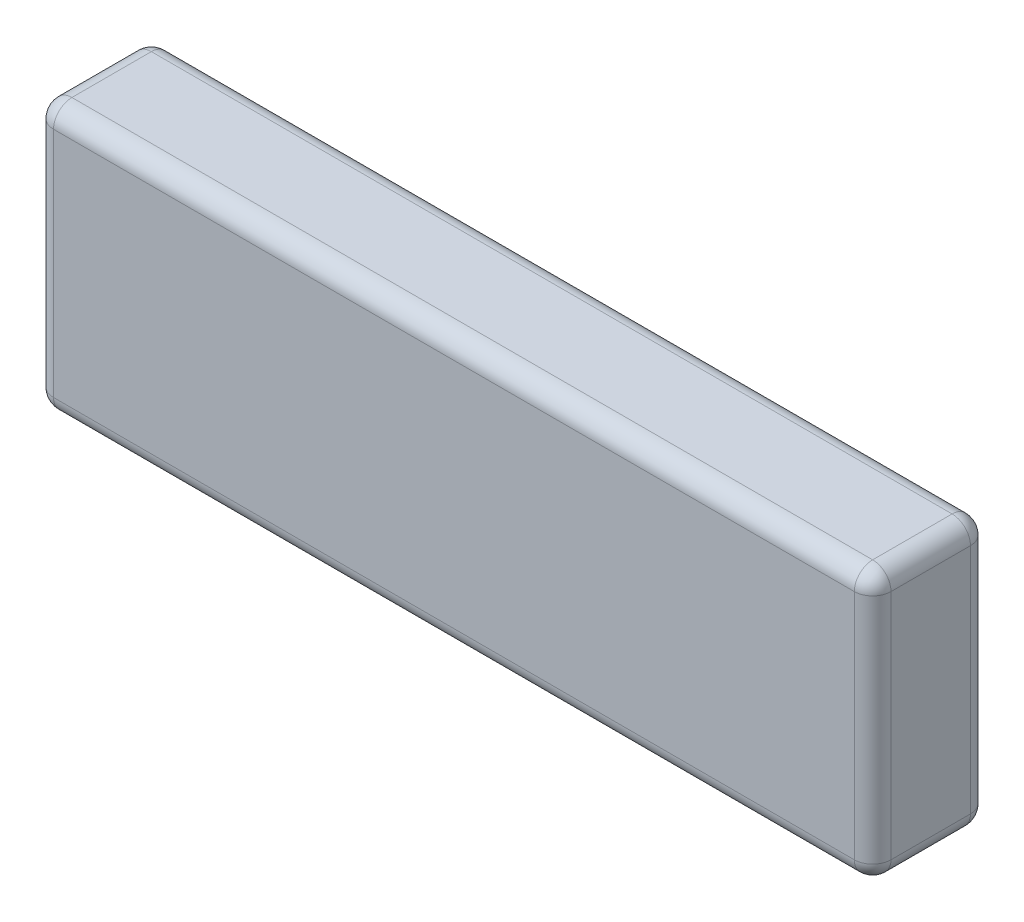
ISO-10303-21;
HEADER;
FILE_DESCRIPTION(('STEP AP214'),'2;1');
FILE_NAME('part.step','',(''),(''),'','','');
FILE_SCHEMA(('AUTOMOTIVE_DESIGN { 1 0 10303 214 1 1 1 1 }'));
ENDSEC;
DATA;
#1=APPLICATION_CONTEXT('core data for automotive mechanical design processes');
#2=APPLICATION_PROTOCOL_DEFINITION('international standard','automotive_design',2000,#1);
#3=PRODUCT_CONTEXT('',#1,'mechanical');
#4=PRODUCT('Part','Part','',(#3));
#5=PRODUCT_RELATED_PRODUCT_CATEGORY('part','',(#4));
#6=PRODUCT_DEFINITION_FORMATION('','',#4);
#7=PRODUCT_DEFINITION_CONTEXT('part definition',#1,'design');
#8=PRODUCT_DEFINITION('design','',#6,#7);
#9=PRODUCT_DEFINITION_SHAPE('','',#8);
#10=(LENGTH_UNIT() NAMED_UNIT(*) SI_UNIT(.MILLI.,.METRE.));
#11=(NAMED_UNIT(*) PLANE_ANGLE_UNIT() SI_UNIT($,.RADIAN.));
#12=(NAMED_UNIT(*) SI_UNIT($,.STERADIAN.) SOLID_ANGLE_UNIT());
#13=UNCERTAINTY_MEASURE_WITH_UNIT(LENGTH_MEASURE(1.E-05),#10,'distance_accuracy_value','');
#14=(GEOMETRIC_REPRESENTATION_CONTEXT(3) GLOBAL_UNCERTAINTY_ASSIGNED_CONTEXT((#13)) GLOBAL_UNIT_ASSIGNED_CONTEXT((#10,
#11,#12)) REPRESENTATION_CONTEXT('',''));
#15=CARTESIAN_POINT('',(0.,0.,0.));
#16=DIRECTION('',(0.,0.,1.));
#17=DIRECTION('',(1.,0.,0.));
#18=AXIS2_PLACEMENT_3D('',#15,#16,#17);
#19=CARTESIAN_POINT('',(65.5,19.,19.));
#20=DIRECTION('',(0.,0.,-1.));
#21=DIRECTION('',(-1.,0.,0.));
#22=AXIS2_PLACEMENT_3D('',#19,#20,#21);
#23=CYLINDRICAL_SURFACE('',#22,3.);
#24=CARTESIAN_POINT('',(65.5,19.,3.));
#25=DIRECTION('',(0.,0.,-1.));
#26=DIRECTION('',(-1.,0.,0.));
#27=AXIS2_PLACEMENT_3D('',#24,#25,#26);
#28=CIRCLE('',#27,3.);
#29=CARTESIAN_POINT('',(65.5,22.,3.));
#30=VERTEX_POINT('',#29);
#31=CARTESIAN_POINT('',(68.5,19.,3.));
#32=VERTEX_POINT('',#31);
#33=EDGE_CURVE('E11',#30,#32,#28,.T.);
#34=ORIENTED_EDGE('',*,*,#33,.F.);
#35=DIRECTION('',(0.,0.,-1.));
#36=VECTOR('',#35,1.);
#37=CARTESIAN_POINT('',(65.5,22.,19.));
#38=LINE('',#37,#36);
#39=CARTESIAN_POINT('',(65.5,22.,16.));
#40=VERTEX_POINT('',#39);
#41=EDGE_CURVE('E236',#40,#30,#38,.T.);
#42=ORIENTED_EDGE('',*,*,#41,.F.);
#43=CARTESIAN_POINT('',(65.5,19.,16.));
#44=DIRECTION('',(0.,0.,-1.));
#45=DIRECTION('',(-1.,0.,0.));
#46=AXIS2_PLACEMENT_3D('',#43,#44,#45);
#47=CIRCLE('',#46,3.);
#48=CARTESIAN_POINT('',(68.5,19.,16.));
#49=VERTEX_POINT('',#48);
#50=EDGE_CURVE('E42',#40,#49,#47,.T.);
#51=ORIENTED_EDGE('',*,*,#50,.T.);
#52=DIRECTION('',(0.,0.,-1.));
#53=VECTOR('',#52,1.);
#54=CARTESIAN_POINT('',(68.5,19.,19.));
#55=LINE('',#54,#53);
#56=EDGE_CURVE('E211',#32,#49,#55,.F.);
#57=ORIENTED_EDGE('',*,*,#56,.F.);
#58=EDGE_LOOP('',(#34,#42,#51,#57));
#59=FACE_BOUND('',#58,.T.);
#60=ADVANCED_FACE('F35',(#59),#23,.T.);
#61=CARTESIAN_POINT('',(65.5,19.,16.));
#62=DIRECTION('',(-1.,0.,0.));
#63=DIRECTION('',(0.,0.,1.));
#64=AXIS2_PLACEMENT_3D('',#61,#62,#63);
#65=SPHERICAL_SURFACE('',#64,3.);
#66=ORIENTED_EDGE('',*,*,#50,.F.);
#67=CARTESIAN_POINT('',(65.5,19.,16.));
#68=DIRECTION('',(1.,0.,0.));
#69=DIRECTION('',(0.,0.,-1.));
#70=AXIS2_PLACEMENT_3D('',#67,#68,#69);
#71=CIRCLE('',#70,3.);
#72=CARTESIAN_POINT('',(65.5,19.,19.));
#73=VERTEX_POINT('',#72);
#74=EDGE_CURVE('E157',#73,#40,#71,.F.);
#75=ORIENTED_EDGE('',*,*,#74,.F.);
#76=CARTESIAN_POINT('',(65.5,19.,16.));
#77=DIRECTION('',(0.,1.,0.));
#78=DIRECTION('',(0.,0.,1.));
#79=AXIS2_PLACEMENT_3D('',#76,#77,#78);
#80=CIRCLE('',#79,3.);
#81=EDGE_CURVE('E55',#73,#49,#80,.T.);
#82=ORIENTED_EDGE('',*,*,#81,.T.);
#83=EDGE_LOOP('',(#66,#75,#82));
#84=FACE_BOUND('',#83,.T.);
#85=ADVANCED_FACE('F253',(#84),#65,.T.);
#86=CARTESIAN_POINT('',(65.5,0.,16.));
#87=DIRECTION('',(0.,-1.,0.));
#88=DIRECTION('',(0.,0.,-1.));
#89=AXIS2_PLACEMENT_3D('',#86,#87,#88);
#90=CYLINDRICAL_SURFACE('',#89,3.);
#91=ORIENTED_EDGE('',*,*,#81,.F.);
#92=DIRECTION('',(0.,1.,0.));
#93=VECTOR('',#92,1.);
#94=CARTESIAN_POINT('',(65.5,0.,19.));
#95=LINE('',#94,#93);
#96=CARTESIAN_POINT('',(65.5,-19.,19.));
#97=VERTEX_POINT('',#96);
#98=EDGE_CURVE('E232',#97,#73,#95,.T.);
#99=ORIENTED_EDGE('',*,*,#98,.F.);
#100=CARTESIAN_POINT('',(65.5,-19.,16.));
#101=DIRECTION('',(0.,1.,0.));
#102=DIRECTION('',(0.,0.,1.));
#103=AXIS2_PLACEMENT_3D('',#100,#101,#102);
#104=CIRCLE('',#103,3.);
#105=CARTESIAN_POINT('',(68.5,-19.,16.));
#106=VERTEX_POINT('',#105);
#107=EDGE_CURVE('E249',#97,#106,#104,.T.);
#108=ORIENTED_EDGE('',*,*,#107,.T.);
#109=DIRECTION('',(0.,1.,0.));
#110=VECTOR('',#109,1.);
#111=CARTESIAN_POINT('',(68.5,0.,16.));
#112=LINE('',#111,#110);
#113=EDGE_CURVE('E214',#49,#106,#112,.F.);
#114=ORIENTED_EDGE('',*,*,#113,.F.);
#115=EDGE_LOOP('',(#91,#99,#108,#114));
#116=FACE_BOUND('',#115,.T.);
#117=ADVANCED_FACE('F254',(#116),#90,.T.);
#118=CARTESIAN_POINT('',(65.5,-19.,16.));
#119=DIRECTION('',(-1.,0.,0.));
#120=DIRECTION('',(0.,0.,1.));
#121=AXIS2_PLACEMENT_3D('',#118,#119,#120);
#122=SPHERICAL_SURFACE('',#121,3.);
#123=ORIENTED_EDGE('',*,*,#107,.F.);
#124=CARTESIAN_POINT('',(65.5,-19.,16.));
#125=DIRECTION('',(1.,0.,0.));
#126=DIRECTION('',(0.,0.,-1.));
#127=AXIS2_PLACEMENT_3D('',#124,#125,#126);
#128=CIRCLE('',#127,3.);
#129=CARTESIAN_POINT('',(65.5,-22.,16.));
#130=VERTEX_POINT('',#129);
#131=EDGE_CURVE('E229',#130,#97,#128,.F.);
#132=ORIENTED_EDGE('',*,*,#131,.F.);
#133=CARTESIAN_POINT('',(65.5,-19.,16.));
#134=DIRECTION('',(0.,0.,1.));
#135=DIRECTION('',(1.,0.,0.));
#136=AXIS2_PLACEMENT_3D('',#133,#134,#135);
#137=CIRCLE('',#136,3.);
#138=EDGE_CURVE('E246',#130,#106,#137,.T.);
#139=ORIENTED_EDGE('',*,*,#138,.T.);
#140=EDGE_LOOP('',(#123,#132,#139));
#141=FACE_BOUND('',#140,.T.);
#142=ADVANCED_FACE('F337',(#141),#122,.T.);
#143=CARTESIAN_POINT('',(65.5,-19.,19.));
#144=DIRECTION('',(0.,0.,1.));
#145=DIRECTION('',(1.,0.,0.));
#146=AXIS2_PLACEMENT_3D('',#143,#144,#145);
#147=CYLINDRICAL_SURFACE('',#146,3.);
#148=ORIENTED_EDGE('',*,*,#138,.F.);
#149=DIRECTION('',(0.,0.,1.));
#150=VECTOR('',#149,1.);
#151=CARTESIAN_POINT('',(65.5,-22.,19.));
#152=LINE('',#151,#150);
#153=CARTESIAN_POINT('',(65.5,-22.,3.));
#154=VERTEX_POINT('',#153);
#155=EDGE_CURVE('E226',#154,#130,#152,.T.);
#156=ORIENTED_EDGE('',*,*,#155,.F.);
#157=CARTESIAN_POINT('',(65.5,-19.,3.));
#158=DIRECTION('',(0.,0.,1.));
#159=DIRECTION('',(1.,0.,0.));
#160=AXIS2_PLACEMENT_3D('',#157,#158,#159);
#161=CIRCLE('',#160,3.);
#162=CARTESIAN_POINT('',(68.5,-19.,3.));
#163=VERTEX_POINT('',#162);
#164=EDGE_CURVE('E244',#154,#163,#161,.T.);
#165=ORIENTED_EDGE('',*,*,#164,.T.);
#166=DIRECTION('',(0.,0.,1.));
#167=VECTOR('',#166,1.);
#168=CARTESIAN_POINT('',(68.5,-19.,19.));
#169=LINE('',#168,#167);
#170=EDGE_CURVE('E217',#106,#163,#169,.F.);
#171=ORIENTED_EDGE('',*,*,#170,.F.);
#172=EDGE_LOOP('',(#148,#156,#165,#171));
#173=FACE_BOUND('',#172,.T.);
#174=ADVANCED_FACE('F342',(#173),#147,.T.);
#175=CARTESIAN_POINT('',(65.5,-19.,3.));
#176=DIRECTION('',(-1.,0.,0.));
#177=DIRECTION('',(0.,0.,1.));
#178=AXIS2_PLACEMENT_3D('',#175,#176,#177);
#179=SPHERICAL_SURFACE('',#178,3.);
#180=ORIENTED_EDGE('',*,*,#164,.F.);
#181=CARTESIAN_POINT('',(65.5,-19.,3.));
#182=DIRECTION('',(1.,0.,0.));
#183=DIRECTION('',(0.,0.,-1.));
#184=AXIS2_PLACEMENT_3D('',#181,#182,#183);
#185=CIRCLE('',#184,3.);
#186=CARTESIAN_POINT('',(65.5,-19.,0.));
#187=VERTEX_POINT('',#186);
#188=EDGE_CURVE('E223',#187,#154,#185,.F.);
#189=ORIENTED_EDGE('',*,*,#188,.F.);
#190=CARTESIAN_POINT('',(65.5,-19.,3.));
#191=DIRECTION('',(0.,-1.,0.));
#192=DIRECTION('',(0.,0.,-1.));
#193=AXIS2_PLACEMENT_3D('',#190,#191,#192);
#194=CIRCLE('',#193,3.);
#195=EDGE_CURVE('E241',#187,#163,#194,.T.);
#196=ORIENTED_EDGE('',*,*,#195,.T.);
#197=EDGE_LOOP('',(#180,#189,#196));
#198=FACE_BOUND('',#197,.T.);
#199=ADVANCED_FACE('F308',(#198),#179,.T.);
#200=CARTESIAN_POINT('',(65.5,0.,3.));
#201=DIRECTION('',(0.,-1.,0.));
#202=DIRECTION('',(0.,0.,-1.));
#203=AXIS2_PLACEMENT_3D('',#200,#201,#202);
#204=CYLINDRICAL_SURFACE('',#203,3.);
#205=ORIENTED_EDGE('',*,*,#195,.F.);
#206=DIRECTION('',(0.,-1.,0.));
#207=VECTOR('',#206,1.);
#208=CARTESIAN_POINT('',(65.5,0.,0.));
#209=LINE('',#208,#207);
#210=CARTESIAN_POINT('',(65.5,19.,0.));
#211=VERTEX_POINT('',#210);
#212=EDGE_CURVE('E208',#211,#187,#209,.T.);
#213=ORIENTED_EDGE('',*,*,#212,.F.);
#214=CARTESIAN_POINT('',(65.5,19.,3.));
#215=DIRECTION('',(0.,-1.,0.));
#216=DIRECTION('',(0.,0.,-1.));
#217=AXIS2_PLACEMENT_3D('',#214,#215,#216);
#218=CIRCLE('',#217,3.);
#219=EDGE_CURVE('E238',#211,#32,#218,.T.);
#220=ORIENTED_EDGE('',*,*,#219,.T.);
#221=DIRECTION('',(0.,-1.,0.));
#222=VECTOR('',#221,1.);
#223=CARTESIAN_POINT('',(68.5,-22.,3.));
#224=LINE('',#223,#222);
#225=EDGE_CURVE('E220',#163,#32,#224,.F.);
#226=ORIENTED_EDGE('',*,*,#225,.F.);
#227=EDGE_LOOP('',(#205,#213,#220,#226));
#228=FACE_BOUND('',#227,.T.);
#229=ADVANCED_FACE('F260',(#228),#204,.T.);
#230=CARTESIAN_POINT('',(65.5,19.,3.));
#231=DIRECTION('',(-1.,0.,0.));
#232=DIRECTION('',(0.,0.,1.));
#233=AXIS2_PLACEMENT_3D('',#230,#231,#232);
#234=SPHERICAL_SURFACE('',#233,3.);
#235=CARTESIAN_POINT('',(65.5,19.,3.));
#236=DIRECTION('',(1.,0.,0.));
#237=DIRECTION('',(0.,0.,-1.));
#238=AXIS2_PLACEMENT_3D('',#235,#236,#237);
#239=CIRCLE('',#238,3.);
#240=EDGE_CURVE('E205',#30,#211,#239,.F.);
#241=ORIENTED_EDGE('',*,*,#240,.F.);
#242=ORIENTED_EDGE('',*,*,#33,.T.);
#243=ORIENTED_EDGE('',*,*,#219,.F.);
#244=EDGE_LOOP('',(#241,#242,#243));
#245=FACE_BOUND('',#244,.T.);
#246=ADVANCED_FACE('F265',(#245),#234,.T.);
#247=CARTESIAN_POINT('',(-65.5,19.,3.));
#248=DIRECTION('',(0.,0.,1.));
#249=DIRECTION('',(1.,0.,0.));
#250=AXIS2_PLACEMENT_3D('',#247,#248,#249);
#251=SPHERICAL_SURFACE('',#250,3.);
#252=CARTESIAN_POINT('',(-65.5,19.,3.));
#253=DIRECTION('',(1.,0.,0.));
#254=DIRECTION('',(0.,0.,-1.));
#255=AXIS2_PLACEMENT_3D('',#252,#253,#254);
#256=CIRCLE('',#255,3.);
#257=CARTESIAN_POINT('',(-65.5,19.,0.));
#258=VERTEX_POINT('',#257);
#259=CARTESIAN_POINT('',(-65.5,22.,3.));
#260=VERTEX_POINT('',#259);
#261=EDGE_CURVE('E203',#258,#260,#256,.T.);
#262=ORIENTED_EDGE('',*,*,#261,.F.);
#263=CARTESIAN_POINT('',(-65.5,19.,3.));
#264=DIRECTION('',(0.,1.,0.));
#265=DIRECTION('',(0.,0.,1.));
#266=AXIS2_PLACEMENT_3D('',#263,#264,#265);
#267=CIRCLE('',#266,3.);
#268=CARTESIAN_POINT('',(-68.5,19.,3.));
#269=VERTEX_POINT('',#268);
#270=EDGE_CURVE('E201',#258,#269,#267,.T.);
#271=ORIENTED_EDGE('',*,*,#270,.T.);
#272=CARTESIAN_POINT('',(-65.5,19.,3.));
#273=DIRECTION('',(0.,0.,-1.));
#274=DIRECTION('',(-1.,0.,0.));
#275=AXIS2_PLACEMENT_3D('',#272,#273,#274);
#276=CIRCLE('',#275,3.);
#277=EDGE_CURVE('E134',#260,#269,#276,.F.);
#278=ORIENTED_EDGE('',*,*,#277,.F.);
#279=EDGE_LOOP('',(#262,#271,#278));
#280=FACE_BOUND('',#279,.T.);
#281=ADVANCED_FACE('F272',(#280),#251,.T.);
#282=CARTESIAN_POINT('',(-65.5,0.,3.));
#283=DIRECTION('',(0.,1.,0.));
#284=DIRECTION('',(0.,0.,1.));
#285=AXIS2_PLACEMENT_3D('',#282,#283,#284);
#286=CYLINDRICAL_SURFACE('',#285,3.);
#287=ORIENTED_EDGE('',*,*,#270,.F.);
#288=DIRECTION('',(0.,1.,0.));
#289=VECTOR('',#288,1.);
#290=CARTESIAN_POINT('',(-65.5,0.,0.));
#291=LINE('',#290,#289);
#292=CARTESIAN_POINT('',(-65.5,-19.,0.));
#293=VERTEX_POINT('',#292);
#294=EDGE_CURVE('E186',#293,#258,#291,.T.);
#295=ORIENTED_EDGE('',*,*,#294,.F.);
#296=CARTESIAN_POINT('',(-65.5,-19.,3.));
#297=DIRECTION('',(0.,1.,0.));
#298=DIRECTION('',(0.,0.,1.));
#299=AXIS2_PLACEMENT_3D('',#296,#297,#298);
#300=CIRCLE('',#299,3.);
#301=CARTESIAN_POINT('',(-68.5,-19.,3.));
#302=VERTEX_POINT('',#301);
#303=EDGE_CURVE('E199',#293,#302,#300,.T.);
#304=ORIENTED_EDGE('',*,*,#303,.T.);
#305=DIRECTION('',(0.,1.,0.));
#306=VECTOR('',#305,1.);
#307=CARTESIAN_POINT('',(-68.5,-22.,3.));
#308=LINE('',#307,#306);
#309=EDGE_CURVE('E165',#269,#302,#308,.F.);
#310=ORIENTED_EDGE('',*,*,#309,.F.);
#311=EDGE_LOOP('',(#287,#295,#304,#310));
#312=FACE_BOUND('',#311,.T.);
#313=ADVANCED_FACE('F314',(#312),#286,.T.);
#314=CARTESIAN_POINT('',(-65.5,-19.,3.));
#315=DIRECTION('',(1.,0.,0.));
#316=DIRECTION('',(0.,0.,-1.));
#317=AXIS2_PLACEMENT_3D('',#314,#315,#316);
#318=SPHERICAL_SURFACE('',#317,3.);
#319=ORIENTED_EDGE('',*,*,#303,.F.);
#320=CARTESIAN_POINT('',(-65.5,-19.,3.));
#321=DIRECTION('',(1.,0.,0.));
#322=DIRECTION('',(0.,0.,-1.));
#323=AXIS2_PLACEMENT_3D('',#320,#321,#322);
#324=CIRCLE('',#323,3.);
#325=CARTESIAN_POINT('',(-65.5,-22.,3.));
#326=VERTEX_POINT('',#325);
#327=EDGE_CURVE('E180',#326,#293,#324,.T.);
#328=ORIENTED_EDGE('',*,*,#327,.F.);
#329=CARTESIAN_POINT('',(-65.5,-19.,3.));
#330=DIRECTION('',(0.,0.,-1.));
#331=DIRECTION('',(-1.,0.,0.));
#332=AXIS2_PLACEMENT_3D('',#329,#330,#331);
#333=CIRCLE('',#332,3.);
#334=EDGE_CURVE('E196',#326,#302,#333,.T.);
#335=ORIENTED_EDGE('',*,*,#334,.T.);
#336=EDGE_LOOP('',(#319,#328,#335));
#337=FACE_BOUND('',#336,.T.);
#338=ADVANCED_FACE('F316',(#337),#318,.T.);
#339=CARTESIAN_POINT('',(-65.5,-19.,19.));
#340=DIRECTION('',(0.,0.,-1.));
#341=DIRECTION('',(-1.,0.,0.));
#342=AXIS2_PLACEMENT_3D('',#339,#340,#341);
#343=CYLINDRICAL_SURFACE('',#342,3.);
#344=ORIENTED_EDGE('',*,*,#334,.F.);
#345=DIRECTION('',(0.,0.,-1.));
#346=VECTOR('',#345,1.);
#347=CARTESIAN_POINT('',(-65.5,-22.,19.));
#348=LINE('',#347,#346);
#349=CARTESIAN_POINT('',(-65.5,-22.,16.));
#350=VERTEX_POINT('',#349);
#351=EDGE_CURVE('E177',#350,#326,#348,.T.);
#352=ORIENTED_EDGE('',*,*,#351,.F.);
#353=CARTESIAN_POINT('',(-65.5,-19.,16.));
#354=DIRECTION('',(0.,0.,-1.));
#355=DIRECTION('',(-1.,0.,0.));
#356=AXIS2_PLACEMENT_3D('',#353,#354,#355);
#357=CIRCLE('',#356,3.);
#358=CARTESIAN_POINT('',(-68.5,-19.,16.));
#359=VERTEX_POINT('',#358);
#360=EDGE_CURVE('E194',#350,#359,#357,.T.);
#361=ORIENTED_EDGE('',*,*,#360,.T.);
#362=DIRECTION('',(0.,0.,-1.));
#363=VECTOR('',#362,1.);
#364=CARTESIAN_POINT('',(-68.5,-19.,19.));
#365=LINE('',#364,#363);
#366=EDGE_CURVE('E168',#302,#359,#365,.F.);
#367=ORIENTED_EDGE('',*,*,#366,.F.);
#368=EDGE_LOOP('',(#344,#352,#361,#367));
#369=FACE_BOUND('',#368,.T.);
#370=ADVANCED_FACE('F318',(#369),#343,.T.);
#371=CARTESIAN_POINT('',(-65.5,-19.,16.));
#372=DIRECTION('',(1.,0.,0.));
#373=DIRECTION('',(0.,0.,-1.));
#374=AXIS2_PLACEMENT_3D('',#371,#372,#373);
#375=SPHERICAL_SURFACE('',#374,3.);
#376=ORIENTED_EDGE('',*,*,#360,.F.);
#377=CARTESIAN_POINT('',(-65.5,-19.,16.));
#378=DIRECTION('',(1.,0.,0.));
#379=DIRECTION('',(0.,0.,-1.));
#380=AXIS2_PLACEMENT_3D('',#377,#378,#379);
#381=CIRCLE('',#380,3.);
#382=CARTESIAN_POINT('',(-65.5,-19.,19.));
#383=VERTEX_POINT('',#382);
#384=EDGE_CURVE('E174',#383,#350,#381,.T.);
#385=ORIENTED_EDGE('',*,*,#384,.F.);
#386=CARTESIAN_POINT('',(-65.5,-19.,16.));
#387=DIRECTION('',(0.,-1.,0.));
#388=DIRECTION('',(0.,0.,-1.));
#389=AXIS2_PLACEMENT_3D('',#386,#387,#388);
#390=CIRCLE('',#389,3.);
#391=EDGE_CURVE('E191',#383,#359,#390,.T.);
#392=ORIENTED_EDGE('',*,*,#391,.T.);
#393=EDGE_LOOP('',(#376,#385,#392));
#394=FACE_BOUND('',#393,.T.);
#395=ADVANCED_FACE('F321',(#394),#375,.T.);
#396=CARTESIAN_POINT('',(-65.5,0.,16.));
#397=DIRECTION('',(0.,1.,0.));
#398=DIRECTION('',(0.,0.,1.));
#399=AXIS2_PLACEMENT_3D('',#396,#397,#398);
#400=CYLINDRICAL_SURFACE('',#399,3.);
#401=ORIENTED_EDGE('',*,*,#391,.F.);
#402=DIRECTION('',(0.,-1.,0.));
#403=VECTOR('',#402,1.);
#404=CARTESIAN_POINT('',(-65.5,0.,19.));
#405=LINE('',#404,#403);
#406=CARTESIAN_POINT('',(-65.5,19.,19.));
#407=VERTEX_POINT('',#406);
#408=EDGE_CURVE('E133',#407,#383,#405,.T.);
#409=ORIENTED_EDGE('',*,*,#408,.F.);
#410=CARTESIAN_POINT('',(-65.5,19.,16.));
#411=DIRECTION('',(0.,-1.,0.));
#412=DIRECTION('',(1.,0.,0.));
#413=AXIS2_PLACEMENT_3D('',#410,#411,#412);
#414=CIRCLE('',#413,3.);
#415=CARTESIAN_POINT('',(-68.5,19.,16.));
#416=VERTEX_POINT('',#415);
#417=EDGE_CURVE('E150',#407,#416,#414,.T.);
#418=ORIENTED_EDGE('',*,*,#417,.T.);
#419=DIRECTION('',(0.,-1.,0.));
#420=VECTOR('',#419,1.);
#421=CARTESIAN_POINT('',(-68.5,0.,16.));
#422=LINE('',#421,#420);
#423=EDGE_CURVE('E171',#359,#416,#422,.F.);
#424=ORIENTED_EDGE('',*,*,#423,.F.);
#425=EDGE_LOOP('',(#401,#409,#418,#424));
#426=FACE_BOUND('',#425,.T.);
#427=ADVANCED_FACE('F279',(#426),#400,.T.);
#428=CARTESIAN_POINT('',(-65.5,19.,16.));
#429=DIRECTION('',(0.,0.,1.));
#430=DIRECTION('',(1.,0.,0.));
#431=AXIS2_PLACEMENT_3D('',#428,#429,#430);
#432=SPHERICAL_SURFACE('',#431,3.);
#433=ORIENTED_EDGE('',*,*,#417,.F.);
#434=CARTESIAN_POINT('',(-65.5,19.,16.));
#435=DIRECTION('',(1.,0.,0.));
#436=DIRECTION('',(0.,0.,-1.));
#437=AXIS2_PLACEMENT_3D('',#434,#435,#436);
#438=CIRCLE('',#437,3.);
#439=CARTESIAN_POINT('',(-65.5,22.,16.));
#440=VERTEX_POINT('',#439);
#441=EDGE_CURVE('E148',#440,#407,#438,.T.);
#442=ORIENTED_EDGE('',*,*,#441,.F.);
#443=CARTESIAN_POINT('',(-65.5,19.,16.));
#444=DIRECTION('',(0.,0.,-1.));
#445=DIRECTION('',(-1.,0.,0.));
#446=AXIS2_PLACEMENT_3D('',#443,#444,#445);
#447=CIRCLE('',#446,3.);
#448=EDGE_CURVE('E123',#416,#440,#447,.T.);
#449=ORIENTED_EDGE('',*,*,#448,.F.);
#450=EDGE_LOOP('',(#433,#442,#449));
#451=FACE_BOUND('',#450,.T.);
#452=ADVANCED_FACE('F149',(#451),#432,.T.);
#453=CARTESIAN_POINT('',(0.,19.,3.));
#454=DIRECTION('',(1.,0.,0.));
#455=DIRECTION('',(0.,0.,-1.));
#456=AXIS2_PLACEMENT_3D('',#453,#454,#455);
#457=CYLINDRICAL_SURFACE('',#456,3.);
#458=DIRECTION('',(1.,0.,0.));
#459=VECTOR('',#458,1.);
#460=CARTESIAN_POINT('',(68.5,22.,3.));
#461=LINE('',#460,#459);
#462=EDGE_CURVE('E143',#30,#260,#461,.F.);
#463=ORIENTED_EDGE('',*,*,#462,.F.);
#464=ORIENTED_EDGE('',*,*,#240,.T.);
#465=DIRECTION('',(1.,0.,0.));
#466=VECTOR('',#465,1.);
#467=CARTESIAN_POINT('',(0.,19.,0.));
#468=LINE('',#467,#466);
#469=EDGE_CURVE('E183',#258,#211,#468,.T.);
#470=ORIENTED_EDGE('',*,*,#469,.F.);
#471=ORIENTED_EDGE('',*,*,#261,.T.);
#472=EDGE_LOOP('',(#463,#464,#470,#471));
#473=FACE_BOUND('',#472,.T.);
#474=ADVANCED_FACE('F268',(#473),#457,.T.);
#475=CARTESIAN_POINT('',(0.,19.,16.));
#476=DIRECTION('',(1.,0.,0.));
#477=DIRECTION('',(0.,0.,-1.));
#478=AXIS2_PLACEMENT_3D('',#475,#476,#477);
#479=CYLINDRICAL_SURFACE('',#478,3.);
#480=DIRECTION('',(-1.,0.,0.));
#481=VECTOR('',#480,1.);
#482=CARTESIAN_POINT('',(0.,19.,19.));
#483=LINE('',#482,#481);
#484=EDGE_CURVE('E145',#73,#407,#483,.T.);
#485=ORIENTED_EDGE('',*,*,#484,.F.);
#486=ORIENTED_EDGE('',*,*,#74,.T.);
#487=DIRECTION('',(-1.,0.,0.));
#488=VECTOR('',#487,1.);
#489=CARTESIAN_POINT('',(0.,22.,16.));
#490=LINE('',#489,#488);
#491=EDGE_CURVE('E141',#440,#40,#490,.F.);
#492=ORIENTED_EDGE('',*,*,#491,.F.);
#493=ORIENTED_EDGE('',*,*,#441,.T.);
#494=EDGE_LOOP('',(#485,#486,#492,#493));
#495=FACE_BOUND('',#494,.T.);
#496=ADVANCED_FACE('F156',(#495),#479,.T.);
#497=CARTESIAN_POINT('',(-65.5,19.,19.));
#498=DIRECTION('',(0.,0.,-1.));
#499=DIRECTION('',(-1.,0.,0.));
#500=AXIS2_PLACEMENT_3D('',#497,#498,#499);
#501=CYLINDRICAL_SURFACE('',#500,3.);
#502=DIRECTION('',(0.,0.,-1.));
#503=VECTOR('',#502,1.);
#504=CARTESIAN_POINT('',(-68.5,19.,19.));
#505=LINE('',#504,#503);
#506=EDGE_CURVE('E129',#416,#269,#505,.T.);
#507=ORIENTED_EDGE('',*,*,#506,.F.);
#508=ORIENTED_EDGE('',*,*,#448,.T.);
#509=DIRECTION('',(0.,0.,-1.));
#510=VECTOR('',#509,1.);
#511=CARTESIAN_POINT('',(-65.5,22.,19.));
#512=LINE('',#511,#510);
#513=EDGE_CURVE('E127',#260,#440,#512,.F.);
#514=ORIENTED_EDGE('',*,*,#513,.F.);
#515=ORIENTED_EDGE('',*,*,#277,.T.);
#516=EDGE_LOOP('',(#507,#508,#514,#515));
#517=FACE_BOUND('',#516,.T.);
#518=ADVANCED_FACE('F125',(#517),#501,.T.);
#519=CARTESIAN_POINT('',(68.5,-19.,16.));
#520=DIRECTION('',(1.,0.,0.));
#521=DIRECTION('',(0.,0.,-1.));
#522=AXIS2_PLACEMENT_3D('',#519,#520,#521);
#523=CYLINDRICAL_SURFACE('',#522,3.);
#524=DIRECTION('',(-1.,0.,0.));
#525=VECTOR('',#524,1.);
#526=CARTESIAN_POINT('',(68.5,-22.,16.));
#527=LINE('',#526,#525);
#528=EDGE_CURVE('E290',#130,#350,#527,.T.);
#529=ORIENTED_EDGE('',*,*,#528,.F.);
#530=ORIENTED_EDGE('',*,*,#131,.T.);
#531=DIRECTION('',(-1.,0.,0.));
#532=VECTOR('',#531,1.);
#533=CARTESIAN_POINT('',(68.5,-19.,19.));
#534=LINE('',#533,#532);
#535=EDGE_CURVE('E285',#383,#97,#534,.F.);
#536=ORIENTED_EDGE('',*,*,#535,.F.);
#537=ORIENTED_EDGE('',*,*,#384,.T.);
#538=EDGE_LOOP('',(#529,#530,#536,#537));
#539=FACE_BOUND('',#538,.T.);
#540=ADVANCED_FACE('F288',(#539),#523,.T.);
#541=CARTESIAN_POINT('',(68.5,-19.,3.));
#542=DIRECTION('',(1.,0.,0.));
#543=DIRECTION('',(0.,0.,-1.));
#544=AXIS2_PLACEMENT_3D('',#541,#542,#543);
#545=CYLINDRICAL_SURFACE('',#544,3.);
#546=DIRECTION('',(1.,0.,0.));
#547=VECTOR('',#546,1.);
#548=CARTESIAN_POINT('',(0.,-19.,0.));
#549=LINE('',#548,#547);
#550=EDGE_CURVE('E292',#187,#293,#549,.F.);
#551=ORIENTED_EDGE('',*,*,#550,.F.);
#552=ORIENTED_EDGE('',*,*,#188,.T.);
#553=DIRECTION('',(1.,0.,0.));
#554=VECTOR('',#553,1.);
#555=CARTESIAN_POINT('',(68.5,-22.,3.));
#556=LINE('',#555,#554);
#557=EDGE_CURVE('E296',#326,#154,#556,.T.);
#558=ORIENTED_EDGE('',*,*,#557,.F.);
#559=ORIENTED_EDGE('',*,*,#327,.T.);
#560=EDGE_LOOP('',(#551,#552,#558,#559));
#561=FACE_BOUND('',#560,.T.);
#562=ADVANCED_FACE('F305',(#561),#545,.T.);
#563=CARTESIAN_POINT('',(-68.5,-22.,19.));
#564=DIRECTION('',(1.,0.,0.));
#565=DIRECTION('',(0.,0.,-1.));
#566=AXIS2_PLACEMENT_3D('',#563,#564,#565);
#567=PLANE('',#566);
#568=ORIENTED_EDGE('',*,*,#366,.T.);
#569=ORIENTED_EDGE('',*,*,#423,.T.);
#570=ORIENTED_EDGE('',*,*,#506,.T.);
#571=ORIENTED_EDGE('',*,*,#309,.T.);
#572=EDGE_LOOP('',(#568,#569,#570,#571));
#573=FACE_BOUND('',#572,.T.);
#574=ADVANCED_FACE('F275',(#573),#567,.F.);
#575=CARTESIAN_POINT('',(68.5,-22.,19.));
#576=DIRECTION('',(0.,1.,0.));
#577=DIRECTION('',(0.,0.,1.));
#578=AXIS2_PLACEMENT_3D('',#575,#576,#577);
#579=PLANE('',#578);
#580=ORIENTED_EDGE('',*,*,#557,.T.);
#581=ORIENTED_EDGE('',*,*,#155,.T.);
#582=ORIENTED_EDGE('',*,*,#528,.T.);
#583=ORIENTED_EDGE('',*,*,#351,.T.);
#584=EDGE_LOOP('',(#580,#581,#582,#583));
#585=FACE_BOUND('',#584,.T.);
#586=ADVANCED_FACE('F300',(#585),#579,.F.);
#587=CARTESIAN_POINT('',(68.5,-22.,19.));
#588=DIRECTION('',(-1.,0.,0.));
#589=DIRECTION('',(0.,0.,1.));
#590=AXIS2_PLACEMENT_3D('',#587,#588,#589);
#591=PLANE('',#590);
#592=ORIENTED_EDGE('',*,*,#170,.T.);
#593=ORIENTED_EDGE('',*,*,#225,.T.);
#594=ORIENTED_EDGE('',*,*,#56,.T.);
#595=ORIENTED_EDGE('',*,*,#113,.T.);
#596=EDGE_LOOP('',(#592,#593,#594,#595));
#597=FACE_BOUND('',#596,.T.);
#598=ADVANCED_FACE('F256',(#597),#591,.F.);
#599=CARTESIAN_POINT('',(68.5,22.,19.));
#600=DIRECTION('',(0.,-1.,0.));
#601=DIRECTION('',(0.,0.,-1.));
#602=AXIS2_PLACEMENT_3D('',#599,#600,#601);
#603=PLANE('',#602);
#604=ORIENTED_EDGE('',*,*,#491,.T.);
#605=ORIENTED_EDGE('',*,*,#41,.T.);
#606=ORIENTED_EDGE('',*,*,#462,.T.);
#607=ORIENTED_EDGE('',*,*,#513,.T.);
#608=EDGE_LOOP('',(#604,#605,#606,#607));
#609=FACE_BOUND('',#608,.T.);
#610=ADVANCED_FACE('F138',(#609),#603,.F.);
#611=CARTESIAN_POINT('',(0.,0.,19.));
#612=DIRECTION('',(0.,0.,1.));
#613=DIRECTION('',(1.,0.,0.));
#614=AXIS2_PLACEMENT_3D('',#611,#612,#613);
#615=PLANE('',#614);
#616=ORIENTED_EDGE('',*,*,#535,.T.);
#617=ORIENTED_EDGE('',*,*,#98,.T.);
#618=ORIENTED_EDGE('',*,*,#484,.T.);
#619=ORIENTED_EDGE('',*,*,#408,.T.);
#620=EDGE_LOOP('',(#616,#617,#618,#619));
#621=FACE_BOUND('',#620,.T.);
#622=ADVANCED_FACE('F284',(#621),#615,.T.);
#623=CARTESIAN_POINT('',(0.,0.,0.));
#624=DIRECTION('',(0.,0.,1.));
#625=DIRECTION('',(1.,0.,0.));
#626=AXIS2_PLACEMENT_3D('',#623,#624,#625);
#627=PLANE('',#626);
#628=ORIENTED_EDGE('',*,*,#469,.T.);
#629=ORIENTED_EDGE('',*,*,#212,.T.);
#630=ORIENTED_EDGE('',*,*,#550,.T.);
#631=ORIENTED_EDGE('',*,*,#294,.T.);
#632=EDGE_LOOP('',(#628,#629,#630,#631));
#633=FACE_BOUND('',#632,.T.);
#634=ADVANCED_FACE('F310',(#633),#627,.F.);
#635=CLOSED_SHELL('',(#60,#85,#117,#142,#174,#199,#229,#246,#281,#313,#338,#370,#395,#427,#452,
#474,#496,#518,#540,#562,#574,#586,#598,#610,#622,#634));
#636=MANIFOLD_SOLID_BREP('B2',#635);
#637=ADVANCED_BREP_SHAPE_REPRESENTATION('',(#18,#636),#14);
#638=SHAPE_DEFINITION_REPRESENTATION(#9,#637);
ENDSEC;
END-ISO-10303-21;
